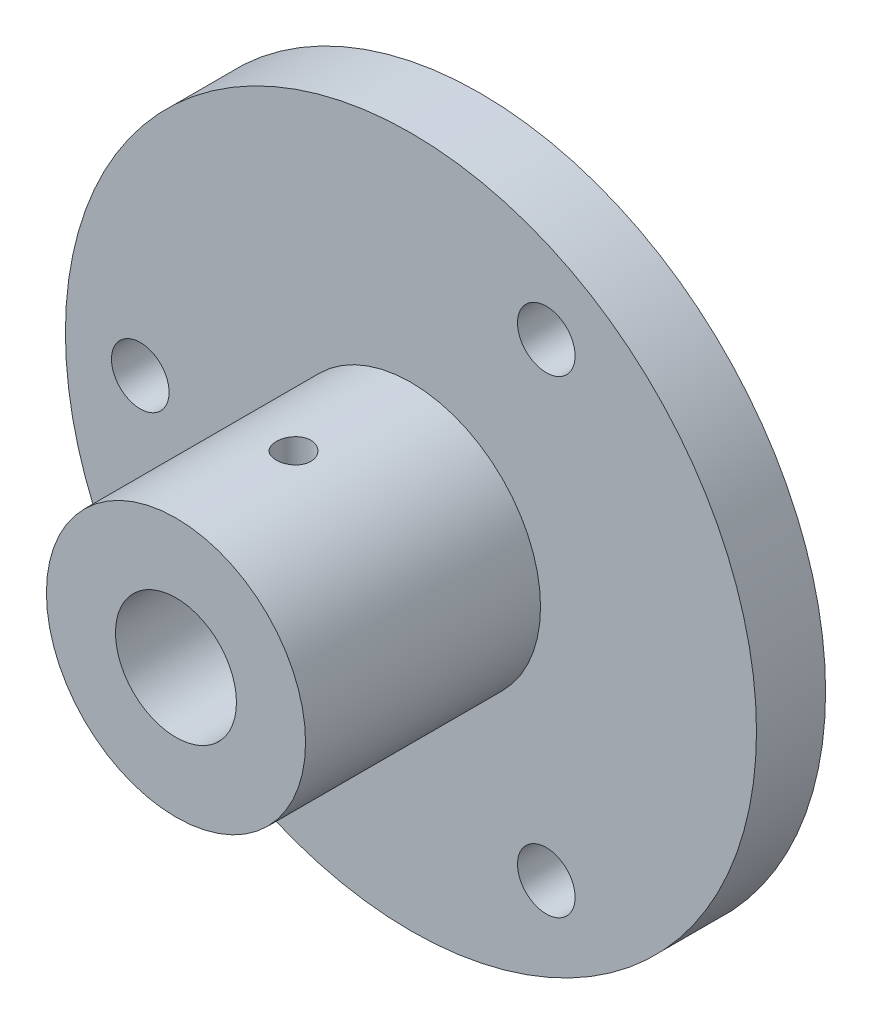
ISO-10303-21;
HEADER;
FILE_DESCRIPTION(('STEP AP214'),'2;1');
FILE_NAME('part.step','',(''),(''),'','','');
FILE_SCHEMA(('AUTOMOTIVE_DESIGN { 1 0 10303 214 1 1 1 1 }'));
ENDSEC;
DATA;
#1=APPLICATION_CONTEXT('core data for automotive mechanical design processes');
#2=APPLICATION_PROTOCOL_DEFINITION('international standard','automotive_design',2000,#1);
#3=PRODUCT_CONTEXT('',#1,'mechanical');
#4=PRODUCT('Part','Part','',(#3));
#5=PRODUCT_RELATED_PRODUCT_CATEGORY('part','',(#4));
#6=PRODUCT_DEFINITION_FORMATION('','',#4);
#7=PRODUCT_DEFINITION_CONTEXT('part definition',#1,'design');
#8=PRODUCT_DEFINITION('design','',#6,#7);
#9=PRODUCT_DEFINITION_SHAPE('','',#8);
#10=(LENGTH_UNIT() NAMED_UNIT(*) SI_UNIT(.MILLI.,.METRE.));
#11=(NAMED_UNIT(*) PLANE_ANGLE_UNIT() SI_UNIT($,.RADIAN.));
#12=(NAMED_UNIT(*) SI_UNIT($,.STERADIAN.) SOLID_ANGLE_UNIT());
#13=UNCERTAINTY_MEASURE_WITH_UNIT(LENGTH_MEASURE(1.E-05),#10,'distance_accuracy_value','');
#14=(GEOMETRIC_REPRESENTATION_CONTEXT(3) GLOBAL_UNCERTAINTY_ASSIGNED_CONTEXT((#13)) GLOBAL_UNIT_ASSIGNED_CONTEXT((#10,
#11,#12)) REPRESENTATION_CONTEXT('',''));
#15=CARTESIAN_POINT('',(0.,0.,0.));
#16=DIRECTION('',(0.,0.,1.));
#17=DIRECTION('',(1.,0.,0.));
#18=AXIS2_PLACEMENT_3D('',#15,#16,#17);
#19=CARTESIAN_POINT('',(0.,0.,6.));
#20=DIRECTION('',(0.,0.,-1.));
#21=DIRECTION('',(-1.,0.,0.));
#22=AXIS2_PLACEMENT_3D('',#19,#20,#21);
#23=CYLINDRICAL_SURFACE('',#22,5.25);
#24=CARTESIAN_POINT('',(0.,-5.25,14.7));
#25=CARTESIAN_POINT('',(0.0824661767829384,-5.24999901970756,14.7000014546715));
#26=CARTESIAN_POINT('',(0.164947310904436,-5.24803813051532,14.7068233417321));
#27=CARTESIAN_POINT('',(0.327518993397741,-5.24040679458827,14.7338732025767));
#28=CARTESIAN_POINT('',(0.407608625122212,-5.23473494407563,14.7541062495556));
#29=CARTESIAN_POINT('',(0.563028225553403,-5.22030518511805,14.8072560288124));
#30=CARTESIAN_POINT('',(0.638364660636168,-5.21155158079756,14.840155077114));
#31=CARTESIAN_POINT('',(0.782451570846953,-5.19187483737408,14.9176334936088));
#32=CARTESIAN_POINT('',(0.851201355883623,-5.18095147131017,14.9622140838678));
#33=CARTESIAN_POINT('',(0.981970835144209,-5.15778550969185,15.0630262580047));
#34=CARTESIAN_POINT('',(1.0437927917857,-5.14551781458893,15.1195085653915));
#35=CARTESIAN_POINT('',(1.15722851844326,-5.12120051186731,15.2419858073533));
#36=CARTESIAN_POINT('',(1.20884075780837,-5.10915093719508,15.3079821657242));
#37=CARTESIAN_POINT('',(1.30139842504823,-5.08637261156541,15.4492451870932));
#38=CARTESIAN_POINT('',(1.34210865827511,-5.07567526879513,15.5246714887986));
#39=CARTESIAN_POINT('',(1.41018877915485,-5.057185078805,15.6816540088131));
#40=CARTESIAN_POINT('',(1.43756153666789,-5.04939160683653,15.7632089040532));
#41=CARTESIAN_POINT('',(1.47748824760406,-5.03785206147012,15.9279260723742));
#42=CARTESIAN_POINT('',(1.49040414902137,-5.03400733927508,16.0109935220759));
#43=CARTESIAN_POINT('',(1.50218000841888,-5.03050656151496,16.1781983613346));
#44=CARTESIAN_POINT('',(1.50104302057216,-5.03084959580709,16.2623355144377));
#45=CARTESIAN_POINT('',(1.48503101072177,-5.03559775807451,16.4264014585921));
#46=CARTESIAN_POINT('',(1.47060244296293,-5.03987087023452,16.5063782633856));
#47=CARTESIAN_POINT('',(1.42913539564342,-5.05178511287108,16.6627254147207));
#48=CARTESIAN_POINT('',(1.40209577610937,-5.05942654782302,16.7390954345404));
#49=CARTESIAN_POINT('',(1.33583010853359,-5.0773264763706,16.8871846833239));
#50=CARTESIAN_POINT('',(1.29645413379661,-5.08761687304236,16.9588328043013));
#51=CARTESIAN_POINT('',(1.20673784375914,-5.10963912661544,17.0946574209101));
#52=CARTESIAN_POINT('',(1.15639508755009,-5.12137130416434,17.1588322483012));
#53=CARTESIAN_POINT('',(1.04392799754766,-5.14549687992267,17.2804292817048));
#54=CARTESIAN_POINT('',(0.981431156133996,-5.15789853429274,17.3375058569754));
#55=CARTESIAN_POINT('',(0.84759921178967,-5.18157185413758,17.4404445027302));
#56=CARTESIAN_POINT('',(0.77626365111142,-5.19284346103369,17.4863059920313));
#57=CARTESIAN_POINT('',(0.626192304818584,-5.21307396049126,17.5656965510805));
#58=CARTESIAN_POINT('',(0.547417363357503,-5.22201956622922,17.5991552151031));
#59=CARTESIAN_POINT('',(0.385044922475602,-5.23649438615689,17.6522504185626));
#60=CARTESIAN_POINT('',(0.30144864435761,-5.24202446142191,17.671890441934));
#61=CARTESIAN_POINT('',(0.134749791483263,-5.24891155886005,17.6962299642821));
#62=CARTESIAN_POINT('',(0.0517210101453815,-5.25039954637952,17.7013985215298));
#63=CARTESIAN_POINT('',(-0.114019895104186,-5.24941563530316,17.6979545502742));
#64=CARTESIAN_POINT('',(-0.196732055817828,-5.24694421185463,17.6893436753656));
#65=CARTESIAN_POINT('',(-0.357763975072738,-5.23840445013913,17.6589671667628));
#66=CARTESIAN_POINT('',(-0.436138658801141,-5.23240959763292,17.6374701140074));
#67=CARTESIAN_POINT('',(-0.588156514654222,-5.21750999056379,17.5822496235115));
#68=CARTESIAN_POINT('',(-0.661799138436506,-5.20860489949282,17.5485247718331));
#69=CARTESIAN_POINT('',(-0.804031263840056,-5.18857470876985,17.4689824975161));
#70=CARTESIAN_POINT('',(-0.87247686490519,-5.17740572384231,17.4229191008807));
#71=CARTESIAN_POINT('',(-1.00082889604448,-5.15413460323354,17.320310620537));
#72=CARTESIAN_POINT('',(-1.06073337813182,-5.14203225564551,17.2637631524528));
#73=CARTESIAN_POINT('',(-1.17232982125553,-5.11776464723921,17.1395929934616));
#74=CARTESIAN_POINT('',(-1.22368907055715,-5.10561027650693,17.0716685433257));
#75=CARTESIAN_POINT('',(-1.31429648704887,-5.08304171044126,16.9279030585365));
#76=CARTESIAN_POINT('',(-1.35354507560828,-5.0726274545694,16.8520622994402));
#77=CARTESIAN_POINT('',(-1.41853090589126,-5.05483988458072,16.6949315917562));
#78=CARTESIAN_POINT('',(-1.44433974931833,-5.04745050118527,16.6136731773205));
#79=CARTESIAN_POINT('',(-1.48184587553056,-5.03656842598251,16.4477175482592));
#80=CARTESIAN_POINT('',(-1.49354743426742,-5.0330745534607,16.3630213836735));
#81=CARTESIAN_POINT('',(-1.50223518184644,-5.03048777321363,16.1960279753088));
#82=CARTESIAN_POINT('',(-1.49976020733171,-5.03123370599554,16.1137608715856));
#83=CARTESIAN_POINT('',(-1.48143533218232,-5.03665947911099,15.9508689520007));
#84=CARTESIAN_POINT('',(-1.4655858778494,-5.04133918817575,15.8702440814302));
#85=CARTESIAN_POINT('',(-1.42129476612471,-5.05400232868674,15.7137162216244));
#86=CARTESIAN_POINT('',(-1.39298318839765,-5.06195157786269,15.6377734597418));
#87=CARTESIAN_POINT('',(-1.32467211976195,-5.08025477132046,15.4916559491306));
#88=CARTESIAN_POINT('',(-1.28467056032367,-5.0906091411192,15.421482224045));
#89=CARTESIAN_POINT('',(-1.19254909901119,-5.11298751712321,15.2863623586461));
#90=CARTESIAN_POINT('',(-1.14006920792048,-5.12505572384263,15.2216689564935));
#91=CARTESIAN_POINT('',(-1.02514488028452,-5.14927383819209,15.1018320781426));
#92=CARTESIAN_POINT('',(-0.962697938046421,-5.16142376562885,15.0466910106669));
#93=CARTESIAN_POINT('',(-0.827680740649044,-5.18480969679264,14.946122111755));
#94=CARTESIAN_POINT('',(-0.754891876769836,-5.19601425778057,14.9009797595478));
#95=CARTESIAN_POINT('',(-0.602437897234997,-5.21588546833481,14.8236406612335));
#96=CARTESIAN_POINT('',(-0.522776568086056,-5.22455350402716,14.7914368410502));
#97=CARTESIAN_POINT('',(-0.369687236501277,-5.2374550854398,14.7443643364534));
#98=CARTESIAN_POINT('',(-0.296822255718294,-5.24212263271557,14.7277698474866));
#99=CARTESIAN_POINT('',(-0.149308776589776,-5.24839532889111,14.7055877570684));
#100=CARTESIAN_POINT('',(-0.0746605182120689,-5.25000088750497,14.6999986830173));
#101=CARTESIAN_POINT('',(0.,-5.25,14.7));
#102=B_SPLINE_CURVE_WITH_KNOTS('',3,(#24,#25,#26,#27,#28,#29,#30,#31,#32,#33,#34,#35,#36,#37,
#38,#39,#40,#41,#42,#43,#44,#45,#46,#47,#48,#49,#50,#51,#52,#53,#54,#55,#56,#57,#58,#59,#60,#61,
#62,#63,#64,#65,#66,#67,#68,#69,#70,#71,#72,#73,#74,#75,#76,#77,#78,#79,#80,#81,#82,#83,#84,#85,
#86,#87,#88,#89,#90,#91,#92,#93,#94,#95,#96,#97,#98,#99,#100,#101),.UNSPECIFIED.,.T.,.F.,(4,2,2,
2,2,2,2,2,2,2,2,2,2,2,2,2,2,2,2,2,2,2,2,2,2,2,2,2,2,2,2,2,2,2,2,2,2,2,4),(0.,0.247124484406758,
0.494342504846385,0.741216609671507,0.988116551576369,1.24085858648086,1.49363848405285,
1.75149806475043,2.00930213658607,2.26049632397063,2.51163591923425,2.75463589372,
2.99765783839594,3.24375602468408,3.48990904183007,3.74533875451876,4.00078170116587,
4.25765325828336,4.51446003010959,4.7628409327365,5.01119203075986,5.2545385535964,
5.49791322431647,5.74655644008339,5.99525627390841,6.25209078663251,6.50891636223973,
6.76435930022607,7.01972479336604,7.26545011208158,7.51116723135287,7.75437822214251,
7.99763227493985,8.24900742663575,8.50044587327156,8.75833484223425,9.01608261921368,
9.23984601024261,9.46357945816591),.UNSPECIFIED.);
#103=CARTESIAN_POINT('',(0.,-5.25,14.7));
#104=VERTEX_POINT('',#103);
#105=EDGE_CURVE('E82',#104,#104,#102,.T.);
#106=ORIENTED_EDGE('',*,*,#105,.T.);
#107=EDGE_LOOP('',(#106));
#108=FACE_BOUND('',#107,.T.);
#109=CARTESIAN_POINT('',(0.,0.,0.));
#110=DIRECTION('',(0.,0.,1.));
#111=DIRECTION('',(1.,0.,0.));
#112=AXIS2_PLACEMENT_3D('',#109,#110,#111);
#113=CIRCLE('',#112,5.25);
#114=CARTESIAN_POINT('',(5.25,0.,0.));
#115=VERTEX_POINT('',#114);
#116=EDGE_CURVE('E134',#115,#115,#113,.T.);
#117=ORIENTED_EDGE('',*,*,#116,.F.);
#118=EDGE_LOOP('',(#117));
#119=FACE_BOUND('',#118,.T.);
#120=CARTESIAN_POINT('',(0.,0.,26.4));
#121=DIRECTION('',(0.,0.,1.));
#122=DIRECTION('',(1.,0.,0.));
#123=AXIS2_PLACEMENT_3D('',#120,#121,#122);
#124=CIRCLE('',#123,5.25);
#125=CARTESIAN_POINT('',(5.25,0.,26.4));
#126=VERTEX_POINT('',#125);
#127=EDGE_CURVE('E160',#126,#126,#124,.T.);
#128=ORIENTED_EDGE('',*,*,#127,.T.);
#129=EDGE_LOOP('',(#128));
#130=FACE_BOUND('',#129,.T.);
#131=CARTESIAN_POINT('',(0.,5.25,14.7));
#132=CARTESIAN_POINT('',(-0.0824661767829384,5.24999901970756,14.7000014546715));
#133=CARTESIAN_POINT('',(-0.164947310904436,5.24803813051532,14.7068233417321));
#134=CARTESIAN_POINT('',(-0.327518993397741,5.24040679458827,14.7338732025767));
#135=CARTESIAN_POINT('',(-0.407608625122212,5.23473494407563,14.7541062495556));
#136=CARTESIAN_POINT('',(-0.563028225553403,5.22030518511805,14.8072560288124));
#137=CARTESIAN_POINT('',(-0.638364660636168,5.21155158079756,14.840155077114));
#138=CARTESIAN_POINT('',(-0.782451570846953,5.19187483737408,14.9176334936088));
#139=CARTESIAN_POINT('',(-0.851201355883623,5.18095147131017,14.9622140838678));
#140=CARTESIAN_POINT('',(-0.981970835144209,5.15778550969185,15.0630262580047));
#141=CARTESIAN_POINT('',(-1.0437927917857,5.14551781458893,15.1195085653915));
#142=CARTESIAN_POINT('',(-1.15722851844326,5.12120051186731,15.2419858073533));
#143=CARTESIAN_POINT('',(-1.20884075780837,5.10915093719508,15.3079821657242));
#144=CARTESIAN_POINT('',(-1.30139842504823,5.08637261156541,15.4492451870932));
#145=CARTESIAN_POINT('',(-1.34210865827511,5.07567526879513,15.5246714887986));
#146=CARTESIAN_POINT('',(-1.41018877915485,5.057185078805,15.6816540088131));
#147=CARTESIAN_POINT('',(-1.43756153666789,5.04939160683653,15.7632089040532));
#148=CARTESIAN_POINT('',(-1.47748824760406,5.03785206147012,15.9279260723742));
#149=CARTESIAN_POINT('',(-1.49040414902137,5.03400733927508,16.0109935220759));
#150=CARTESIAN_POINT('',(-1.50218000841888,5.03050656151496,16.1781983613346));
#151=CARTESIAN_POINT('',(-1.50104302057216,5.03084959580709,16.2623355144377));
#152=CARTESIAN_POINT('',(-1.48503101072177,5.03559775807451,16.4264014585921));
#153=CARTESIAN_POINT('',(-1.47060244296293,5.03987087023452,16.5063782633856));
#154=CARTESIAN_POINT('',(-1.42913539564342,5.05178511287108,16.6627254147207));
#155=CARTESIAN_POINT('',(-1.40209577610937,5.05942654782302,16.7390954345404));
#156=CARTESIAN_POINT('',(-1.33583010853359,5.0773264763706,16.8871846833239));
#157=CARTESIAN_POINT('',(-1.29645413379661,5.08761687304236,16.9588328043013));
#158=CARTESIAN_POINT('',(-1.20673784375914,5.10963912661544,17.0946574209101));
#159=CARTESIAN_POINT('',(-1.15639508755009,5.12137130416434,17.1588322483012));
#160=CARTESIAN_POINT('',(-1.04392799754766,5.14549687992267,17.2804292817048));
#161=CARTESIAN_POINT('',(-0.981431156133996,5.15789853429274,17.3375058569754));
#162=CARTESIAN_POINT('',(-0.84759921178967,5.18157185413758,17.4404445027302));
#163=CARTESIAN_POINT('',(-0.77626365111142,5.19284346103369,17.4863059920313));
#164=CARTESIAN_POINT('',(-0.626192304818584,5.21307396049126,17.5656965510805));
#165=CARTESIAN_POINT('',(-0.547417363357503,5.22201956622922,17.5991552151031));
#166=CARTESIAN_POINT('',(-0.385044922475602,5.23649438615689,17.6522504185626));
#167=CARTESIAN_POINT('',(-0.30144864435761,5.24202446142191,17.671890441934));
#168=CARTESIAN_POINT('',(-0.134749791483263,5.24891155886005,17.6962299642821));
#169=CARTESIAN_POINT('',(-0.0517210101453815,5.25039954637952,17.7013985215298));
#170=CARTESIAN_POINT('',(0.114019895104186,5.24941563530316,17.6979545502742));
#171=CARTESIAN_POINT('',(0.196732055817828,5.24694421185463,17.6893436753656));
#172=CARTESIAN_POINT('',(0.357763975072738,5.23840445013913,17.6589671667628));
#173=CARTESIAN_POINT('',(0.436138658801141,5.23240959763292,17.6374701140074));
#174=CARTESIAN_POINT('',(0.588156514654222,5.21750999056379,17.5822496235115));
#175=CARTESIAN_POINT('',(0.661799138436506,5.20860489949282,17.5485247718331));
#176=CARTESIAN_POINT('',(0.804031263840056,5.18857470876985,17.4689824975161));
#177=CARTESIAN_POINT('',(0.87247686490519,5.17740572384231,17.4229191008807));
#178=CARTESIAN_POINT('',(1.00082889604448,5.15413460323354,17.320310620537));
#179=CARTESIAN_POINT('',(1.06073337813182,5.14203225564551,17.2637631524528));
#180=CARTESIAN_POINT('',(1.17232982125553,5.11776464723921,17.1395929934616));
#181=CARTESIAN_POINT('',(1.22368907055715,5.10561027650693,17.0716685433257));
#182=CARTESIAN_POINT('',(1.31429648704887,5.08304171044126,16.9279030585365));
#183=CARTESIAN_POINT('',(1.35354507560828,5.0726274545694,16.8520622994402));
#184=CARTESIAN_POINT('',(1.41853090589126,5.05483988458072,16.6949315917562));
#185=CARTESIAN_POINT('',(1.44433974931833,5.04745050118527,16.6136731773205));
#186=CARTESIAN_POINT('',(1.48184587553056,5.03656842598251,16.4477175482592));
#187=CARTESIAN_POINT('',(1.49354743426742,5.0330745534607,16.3630213836735));
#188=CARTESIAN_POINT('',(1.50223518184644,5.03048777321363,16.1960279753088));
#189=CARTESIAN_POINT('',(1.49976020733171,5.03123370599554,16.1137608715856));
#190=CARTESIAN_POINT('',(1.48143533218232,5.03665947911099,15.9508689520007));
#191=CARTESIAN_POINT('',(1.4655858778494,5.04133918817575,15.8702440814302));
#192=CARTESIAN_POINT('',(1.42129476612471,5.05400232868674,15.7137162216244));
#193=CARTESIAN_POINT('',(1.39298318839765,5.06195157786269,15.6377734597418));
#194=CARTESIAN_POINT('',(1.32467211976195,5.08025477132046,15.4916559491306));
#195=CARTESIAN_POINT('',(1.28467056032367,5.0906091411192,15.421482224045));
#196=CARTESIAN_POINT('',(1.19254909901119,5.11298751712321,15.2863623586461));
#197=CARTESIAN_POINT('',(1.14006920792048,5.12505572384263,15.2216689564935));
#198=CARTESIAN_POINT('',(1.02514488028452,5.14927383819209,15.1018320781426));
#199=CARTESIAN_POINT('',(0.962697938046421,5.16142376562885,15.0466910106669));
#200=CARTESIAN_POINT('',(0.827680740649044,5.18480969679264,14.946122111755));
#201=CARTESIAN_POINT('',(0.754891876769836,5.19601425778057,14.9009797595478));
#202=CARTESIAN_POINT('',(0.602437897234997,5.21588546833481,14.8236406612335));
#203=CARTESIAN_POINT('',(0.522776568086056,5.22455350402716,14.7914368410502));
#204=CARTESIAN_POINT('',(0.369687236501277,5.2374550854398,14.7443643364534));
#205=CARTESIAN_POINT('',(0.296822255718294,5.24212263271557,14.7277698474866));
#206=CARTESIAN_POINT('',(0.149308776589776,5.24839532889111,14.7055877570684));
#207=CARTESIAN_POINT('',(0.0746605182120689,5.25000088750497,14.6999986830173));
#208=CARTESIAN_POINT('',(0.,5.25,14.7));
#209=B_SPLINE_CURVE_WITH_KNOTS('',3,(#131,#132,#133,#134,#135,#136,#137,#138,#139,#140,#141,
#142,#143,#144,#145,#146,#147,#148,#149,#150,#151,#152,#153,#154,#155,#156,#157,#158,#159,#160,
#161,#162,#163,#164,#165,#166,#167,#168,#169,#170,#171,#172,#173,#174,#175,#176,#177,#178,#179,
#180,#181,#182,#183,#184,#185,#186,#187,#188,#189,#190,#191,#192,#193,#194,#195,#196,#197,#198,
#199,#200,#201,#202,#203,#204,#205,#206,#207,#208),.UNSPECIFIED.,.T.,.F.,(4,2,2,2,2,2,2,2,2,2,2,
2,2,2,2,2,2,2,2,2,2,2,2,2,2,2,2,2,2,2,2,2,2,2,2,2,2,2,4),(0.,0.247124484406758,
0.494342504846385,0.741216609671507,0.988116551576369,1.24085858648086,1.49363848405285,
1.75149806475043,2.00930213658607,2.26049632397063,2.51163591923425,2.75463589372,
2.99765783839594,3.24375602468408,3.48990904183007,3.74533875451876,4.00078170116587,
4.25765325828336,4.51446003010959,4.7628409327365,5.01119203075986,5.2545385535964,
5.49791322431647,5.74655644008339,5.99525627390841,6.25209078663251,6.50891636223973,
6.76435930022607,7.01972479336604,7.26545011208158,7.51116723135287,7.75437822214251,
7.99763227493985,8.24900742663575,8.50044587327156,8.75833484223425,9.01608261921368,
9.23984601024261,9.46357945816591),.UNSPECIFIED.);
#210=CARTESIAN_POINT('',(0.,5.25,14.7));
#211=VERTEX_POINT('',#210);
#212=EDGE_CURVE('E87',#211,#211,#209,.T.);
#213=ORIENTED_EDGE('',*,*,#212,.T.);
#214=EDGE_LOOP('',(#213));
#215=FACE_BOUND('',#214,.T.);
#216=ADVANCED_FACE('F39',(#108,#119,#130,#215),#23,.F.);
#217=CARTESIAN_POINT('',(0.,0.,26.4));
#218=DIRECTION('',(0.,0.,-1.));
#219=DIRECTION('',(-1.,0.,0.));
#220=AXIS2_PLACEMENT_3D('',#217,#218,#219);
#221=CYLINDRICAL_SURFACE('',#220,11.25);
#222=CARTESIAN_POINT('',(0.,0.,26.4));
#223=DIRECTION('',(0.,0.,1.));
#224=DIRECTION('',(1.,0.,0.));
#225=AXIS2_PLACEMENT_3D('',#222,#223,#224);
#226=CIRCLE('',#225,11.25);
#227=CARTESIAN_POINT('',(11.25,0.,26.4));
#228=VERTEX_POINT('',#227);
#229=EDGE_CURVE('E136',#228,#228,#226,.T.);
#230=ORIENTED_EDGE('',*,*,#229,.F.);
#231=EDGE_LOOP('',(#230));
#232=FACE_BOUND('',#231,.T.);
#233=CARTESIAN_POINT('',(0.,0.,6.));
#234=DIRECTION('',(0.,0.,1.));
#235=DIRECTION('',(1.,0.,0.));
#236=AXIS2_PLACEMENT_3D('',#233,#234,#235);
#237=CIRCLE('',#236,11.25);
#238=CARTESIAN_POINT('',(11.25,0.,6.));
#239=VERTEX_POINT('',#238);
#240=EDGE_CURVE('E141',#239,#239,#237,.T.);
#241=ORIENTED_EDGE('',*,*,#240,.T.);
#242=EDGE_LOOP('',(#241));
#243=FACE_BOUND('',#242,.T.);
#244=CARTESIAN_POINT('',(0.,-11.25,14.7));
#245=CARTESIAN_POINT('',(0.0838566267519633,-11.2499987680691,14.7000035322802));
#246=CARTESIAN_POINT('',(0.16776448445721,-11.249052530454,14.7070556534719));
#247=CARTESIAN_POINT('',(0.333242043853559,-11.2453688334518,14.7350747617872));
#248=CARTESIAN_POINT('',(0.414809266749778,-11.2426295433129,14.7560559711729));
#249=CARTESIAN_POINT('',(0.573186234470238,-11.235668098868,14.8113012881561));
#250=CARTESIAN_POINT('',(0.649999262293871,-11.2314469815823,14.8455561082788));
#251=CARTESIAN_POINT('',(0.796772921272724,-11.2219903999529,14.9263551853547));
#252=CARTESIAN_POINT('',(0.866734654752769,-11.2167550991892,14.9728974608748));
#253=CARTESIAN_POINT('',(0.998269366878509,-11.2058174609247,15.0772599462031));
#254=CARTESIAN_POINT('',(1.0597934891219,-11.2001126862158,15.1351414837564));
#255=CARTESIAN_POINT('',(1.17228551754826,-11.1888985316846,15.2604076418075));
#256=CARTESIAN_POINT('',(1.22325286497916,-11.1833891622176,15.3277927649969));
#257=CARTESIAN_POINT('',(1.31336926701681,-11.1731657658014,15.4704743422088));
#258=CARTESIAN_POINT('',(1.35247205611933,-11.1684548832432,15.545800261859));
#259=CARTESIAN_POINT('',(1.41745383755468,-11.1603944053442,15.7020233004276));
#260=CARTESIAN_POINT('',(1.44333339933958,-11.1570447513841,15.782920179265));
#261=CARTESIAN_POINT('',(1.4809845507913,-11.152109524265,15.9474793578762));
#262=CARTESIAN_POINT('',(1.4928390317138,-11.150513590276,16.0311223758997));
#263=CARTESIAN_POINT('',(1.50236010411088,-11.1492348870699,16.1992246347045));
#264=CARTESIAN_POINT('',(1.50002734225201,-11.149552030653,16.2836838381082));
#265=CARTESIAN_POINT('',(1.48130809454426,-11.1520541682974,16.4504408475209));
#266=CARTESIAN_POINT('',(1.46501323148821,-11.1542269846676,16.5327491474143));
#267=CARTESIAN_POINT('',(1.41897543475779,-11.1601766458106,16.6934526275701));
#268=CARTESIAN_POINT('',(1.38923219446093,-11.163953527156,16.7718477185663));
#269=CARTESIAN_POINT('',(1.31704446857393,-11.1726994583327,16.9227822260304));
#270=CARTESIAN_POINT('',(1.27456048435312,-11.1776722059292,16.9953025283957));
#271=CARTESIAN_POINT('',(1.17812545008217,-11.1882467716495,17.1322193114382));
#272=CARTESIAN_POINT('',(1.12417380376789,-11.1938486224765,17.1966153694156));
#273=CARTESIAN_POINT('',(1.00582867519772,-11.2051042442519,17.3159872594364));
#274=CARTESIAN_POINT('',(0.941356280269833,-11.210758076559,17.3708848820267));
#275=CARTESIAN_POINT('',(0.804070627600053,-11.221439428637,17.4690915336963));
#276=CARTESIAN_POINT('',(0.731257345831775,-11.2264669466037,17.5124005293926));
#277=CARTESIAN_POINT('',(0.57929416479785,-11.2353329530768,17.5862018382711));
#278=CARTESIAN_POINT('',(0.50014168413092,-11.2391709540672,17.6166888982847));
#279=CARTESIAN_POINT('',(0.337778193252185,-11.2452211942805,17.6639169892293));
#280=CARTESIAN_POINT('',(0.254567399656691,-11.2474335201745,17.6806587529795));
#281=CARTESIAN_POINT('',(0.0871251774942311,-11.2499718103264,17.6998188245783));
#282=CARTESIAN_POINT('',(0.00290627591028013,-11.2503119538678,17.7023448013376));
#283=CARTESIAN_POINT('',(-0.16475371291404,-11.2491059365389,17.6932862519046));
#284=CARTESIAN_POINT('',(-0.24819481900925,-11.2475598215145,17.6817020686632));
#285=CARTESIAN_POINT('',(-0.411610286679705,-11.2427638151858,17.644841509962));
#286=CARTESIAN_POINT('',(-0.491596512384035,-11.2395203572719,17.6196168237584));
#287=CARTESIAN_POINT('',(-0.646203824095171,-11.2316925694072,17.5562452755472));
#288=CARTESIAN_POINT('',(-0.720824705261729,-11.2271081882958,17.5180979204901));
#289=CARTESIAN_POINT('',(-0.863061658962059,-11.2170737802756,17.4297058833125));
#290=CARTESIAN_POINT('',(-0.930634360797453,-11.2116188628429,17.379391975715));
#291=CARTESIAN_POINT('',(-1.05641471024392,-11.2004679653249,17.2681925030818));
#292=CARTESIAN_POINT('',(-1.11462193246784,-11.1947719743047,17.2073064581127));
#293=CARTESIAN_POINT('',(-1.22040412067324,-11.1837367685513,17.0762151430203));
#294=CARTESIAN_POINT('',(-1.26790745706704,-11.1784001158147,17.0059518249464));
#295=CARTESIAN_POINT('',(-1.35043763309111,-11.1687309975136,16.8583804422893));
#296=CARTESIAN_POINT('',(-1.3854647513276,-11.1643985095259,16.7810725350672));
#297=CARTESIAN_POINT('',(-1.4419337737556,-11.1572460883506,16.6218320684792));
#298=CARTESIAN_POINT('',(-1.46341521635097,-11.1544217567445,16.5399137360919));
#299=CARTESIAN_POINT('',(-1.49231000357969,-11.1505931152372,16.3735922759034));
#300=CARTESIAN_POINT('',(-1.49972410070086,-11.1495887079851,16.2891892812567));
#301=CARTESIAN_POINT('',(-1.50025864354642,-11.1495167347159,16.1210073818599));
#302=CARTESIAN_POINT('',(-1.49349164395869,-11.1504339171189,16.0372288192768));
#303=CARTESIAN_POINT('',(-1.46609532515017,-11.1540688790565,15.8720115936721));
#304=CARTESIAN_POINT('',(-1.44546601112451,-11.1567866579162,15.7905729297735));
#305=CARTESIAN_POINT('',(-1.39096732749155,-11.1637116770457,15.6323672375613));
#306=CARTESIAN_POINT('',(-1.35710415614281,-11.1679182199455,15.5555980416624));
#307=CARTESIAN_POINT('',(-1.27711007069803,-11.1773478428462,15.4088130871305));
#308=CARTESIAN_POINT('',(-1.23097891972821,-11.1825709424745,15.338797458933));
#309=CARTESIAN_POINT('',(-1.12734336382131,-11.193494753873,15.2069327625537));
#310=CARTESIAN_POINT('',(-1.06975520420176,-11.1991987931556,15.1451497891836));
#311=CARTESIAN_POINT('',(-0.945016270123677,-11.2104128925125,15.0320825877288));
#312=CARTESIAN_POINT('',(-0.877863255547331,-11.2159229067673,14.9808008259373));
#313=CARTESIAN_POINT('',(-0.735564740889616,-11.2261547635315,14.8899996461501));
#314=CARTESIAN_POINT('',(-0.660385965557974,-11.2308730982017,14.8505320000836));
#315=CARTESIAN_POINT('',(-0.504444307190497,-11.2389549049423,14.7848395510912));
#316=CARTESIAN_POINT('',(-0.423687509227417,-11.2423198269323,14.7586005685314));
#317=CARTESIAN_POINT('',(-0.285441306073813,-11.2465179130745,14.7262889952111));
#318=CARTESIAN_POINT('',(-0.228818311466833,-11.2478172272631,14.7164450673573));
#319=CARTESIAN_POINT('',(-0.114804878712083,-11.2495586886808,14.7032993893759));
#320=CARTESIAN_POINT('',(-0.05741444733843,-11.250000843471,14.6999975815398));
#321=CARTESIAN_POINT('',(0.,-11.25,14.7));
#322=B_SPLINE_CURVE_WITH_KNOTS('',3,(#244,#245,#246,#247,#248,#249,#250,#251,#252,#253,#254,
#255,#256,#257,#258,#259,#260,#261,#262,#263,#264,#265,#266,#267,#268,#269,#270,#271,#272,#273,
#274,#275,#276,#277,#278,#279,#280,#281,#282,#283,#284,#285,#286,#287,#288,#289,#290,#291,#292,
#293,#294,#295,#296,#297,#298,#299,#300,#301,#302,#303,#304,#305,#306,#307,#308,#309,#310,#311,
#312,#313,#314,#315,#316,#317,#318,#319,#320,#321),.UNSPECIFIED.,.T.,.F.,(4,2,2,2,2,2,2,2,2,2,2,
2,2,2,2,2,2,2,2,2,2,2,2,2,2,2,2,2,2,2,2,2,2,2,2,2,2,2,4),(0.,0.251360138479308,
0.502977323163784,0.754418769620554,1.00581969423026,1.25861983832669,1.51143335928627,
1.76522041133736,2.01899653324653,2.27126516935769,2.5235223069369,2.77413663823533,
3.02475668381888,3.27616187353424,3.52758013832848,3.78097908363637,4.03437875889222,
4.28788215151904,4.54137202793807,4.79293938744046,5.04450063265859,5.29511522547348,
5.5457393812766,5.79782456077413,6.04992118694071,6.30365778401588,6.55738871454786,
6.81037556051591,7.06334887337726,7.31432195622469,7.56529494501559,7.81615052776966,
8.06701095446927,8.3197775087633,8.57260335938371,8.82652145005887,9.08016678744314,
9.25226804285482,9.42436778014079),.UNSPECIFIED.);
#323=CARTESIAN_POINT('',(0.,-11.25,14.7));
#324=VERTEX_POINT('',#323);
#325=EDGE_CURVE('E62',#324,#324,#322,.T.);
#326=ORIENTED_EDGE('',*,*,#325,.F.);
#327=EDGE_LOOP('',(#326));
#328=FACE_BOUND('',#327,.T.);
#329=CARTESIAN_POINT('',(0.,11.25,14.7));
#330=CARTESIAN_POINT('',(-0.0838566267519633,11.2499987680691,14.7000035322802));
#331=CARTESIAN_POINT('',(-0.16776448445721,11.249052530454,14.7070556534719));
#332=CARTESIAN_POINT('',(-0.333242043853559,11.2453688334518,14.7350747617872));
#333=CARTESIAN_POINT('',(-0.414809266749778,11.2426295433129,14.7560559711729));
#334=CARTESIAN_POINT('',(-0.573186234470238,11.235668098868,14.8113012881561));
#335=CARTESIAN_POINT('',(-0.649999262293871,11.2314469815823,14.8455561082788));
#336=CARTESIAN_POINT('',(-0.796772921272724,11.2219903999529,14.9263551853547));
#337=CARTESIAN_POINT('',(-0.866734654752769,11.2167550991892,14.9728974608748));
#338=CARTESIAN_POINT('',(-0.998269366878509,11.2058174609247,15.0772599462031));
#339=CARTESIAN_POINT('',(-1.0597934891219,11.2001126862158,15.1351414837564));
#340=CARTESIAN_POINT('',(-1.17228551754826,11.1888985316846,15.2604076418075));
#341=CARTESIAN_POINT('',(-1.22325286497916,11.1833891622176,15.3277927649969));
#342=CARTESIAN_POINT('',(-1.31336926701681,11.1731657658014,15.4704743422088));
#343=CARTESIAN_POINT('',(-1.35247205611933,11.1684548832432,15.545800261859));
#344=CARTESIAN_POINT('',(-1.41745383755468,11.1603944053442,15.7020233004276));
#345=CARTESIAN_POINT('',(-1.44333339933958,11.1570447513841,15.782920179265));
#346=CARTESIAN_POINT('',(-1.4809845507913,11.152109524265,15.9474793578762));
#347=CARTESIAN_POINT('',(-1.4928390317138,11.150513590276,16.0311223758997));
#348=CARTESIAN_POINT('',(-1.50236010411088,11.1492348870699,16.1992246347045));
#349=CARTESIAN_POINT('',(-1.50002734225201,11.149552030653,16.2836838381082));
#350=CARTESIAN_POINT('',(-1.48130809454426,11.1520541682974,16.4504408475209));
#351=CARTESIAN_POINT('',(-1.46501323148821,11.1542269846676,16.5327491474143));
#352=CARTESIAN_POINT('',(-1.41897543475779,11.1601766458106,16.6934526275701));
#353=CARTESIAN_POINT('',(-1.38923219446093,11.163953527156,16.7718477185663));
#354=CARTESIAN_POINT('',(-1.31704446857393,11.1726994583327,16.9227822260304));
#355=CARTESIAN_POINT('',(-1.27456048435312,11.1776722059292,16.9953025283957));
#356=CARTESIAN_POINT('',(-1.17812545008217,11.1882467716495,17.1322193114382));
#357=CARTESIAN_POINT('',(-1.12417380376789,11.1938486224765,17.1966153694156));
#358=CARTESIAN_POINT('',(-1.00582867519772,11.2051042442519,17.3159872594364));
#359=CARTESIAN_POINT('',(-0.941356280269833,11.210758076559,17.3708848820267));
#360=CARTESIAN_POINT('',(-0.804070627600053,11.221439428637,17.4690915336963));
#361=CARTESIAN_POINT('',(-0.731257345831775,11.2264669466037,17.5124005293926));
#362=CARTESIAN_POINT('',(-0.57929416479785,11.2353329530768,17.5862018382711));
#363=CARTESIAN_POINT('',(-0.50014168413092,11.2391709540672,17.6166888982847));
#364=CARTESIAN_POINT('',(-0.337778193252185,11.2452211942805,17.6639169892293));
#365=CARTESIAN_POINT('',(-0.254567399656691,11.2474335201745,17.6806587529795));
#366=CARTESIAN_POINT('',(-0.0871251774942311,11.2499718103264,17.6998188245783));
#367=CARTESIAN_POINT('',(-0.00290627591028013,11.2503119538678,17.7023448013376));
#368=CARTESIAN_POINT('',(0.16475371291404,11.2491059365389,17.6932862519046));
#369=CARTESIAN_POINT('',(0.24819481900925,11.2475598215145,17.6817020686632));
#370=CARTESIAN_POINT('',(0.411610286679705,11.2427638151858,17.644841509962));
#371=CARTESIAN_POINT('',(0.491596512384035,11.2395203572719,17.6196168237584));
#372=CARTESIAN_POINT('',(0.646203824095171,11.2316925694072,17.5562452755472));
#373=CARTESIAN_POINT('',(0.720824705261729,11.2271081882958,17.5180979204901));
#374=CARTESIAN_POINT('',(0.863061658962059,11.2170737802756,17.4297058833125));
#375=CARTESIAN_POINT('',(0.930634360797453,11.2116188628429,17.379391975715));
#376=CARTESIAN_POINT('',(1.05641471024392,11.2004679653249,17.2681925030818));
#377=CARTESIAN_POINT('',(1.11462193246784,11.1947719743047,17.2073064581127));
#378=CARTESIAN_POINT('',(1.22040412067324,11.1837367685513,17.0762151430203));
#379=CARTESIAN_POINT('',(1.26790745706704,11.1784001158147,17.0059518249464));
#380=CARTESIAN_POINT('',(1.35043763309111,11.1687309975136,16.8583804422893));
#381=CARTESIAN_POINT('',(1.3854647513276,11.1643985095259,16.7810725350672));
#382=CARTESIAN_POINT('',(1.4419337737556,11.1572460883506,16.6218320684792));
#383=CARTESIAN_POINT('',(1.46341521635097,11.1544217567445,16.5399137360919));
#384=CARTESIAN_POINT('',(1.49231000357969,11.1505931152372,16.3735922759034));
#385=CARTESIAN_POINT('',(1.49972410070086,11.1495887079851,16.2891892812567));
#386=CARTESIAN_POINT('',(1.50025864354642,11.1495167347159,16.1210073818599));
#387=CARTESIAN_POINT('',(1.49349164395869,11.1504339171189,16.0372288192768));
#388=CARTESIAN_POINT('',(1.46609532515017,11.1540688790565,15.8720115936721));
#389=CARTESIAN_POINT('',(1.44546601112451,11.1567866579162,15.7905729297735));
#390=CARTESIAN_POINT('',(1.39096732749155,11.1637116770457,15.6323672375613));
#391=CARTESIAN_POINT('',(1.35710415614281,11.1679182199455,15.5555980416624));
#392=CARTESIAN_POINT('',(1.27711007069803,11.1773478428462,15.4088130871305));
#393=CARTESIAN_POINT('',(1.23097891972821,11.1825709424745,15.338797458933));
#394=CARTESIAN_POINT('',(1.12734336382131,11.193494753873,15.2069327625537));
#395=CARTESIAN_POINT('',(1.06975520420176,11.1991987931556,15.1451497891836));
#396=CARTESIAN_POINT('',(0.945016270123677,11.2104128925125,15.0320825877288));
#397=CARTESIAN_POINT('',(0.877863255547331,11.2159229067673,14.9808008259373));
#398=CARTESIAN_POINT('',(0.735564740889616,11.2261547635315,14.8899996461501));
#399=CARTESIAN_POINT('',(0.660385965557974,11.2308730982017,14.8505320000836));
#400=CARTESIAN_POINT('',(0.504444307190497,11.2389549049423,14.7848395510912));
#401=CARTESIAN_POINT('',(0.423687509227417,11.2423198269323,14.7586005685314));
#402=CARTESIAN_POINT('',(0.285441306073813,11.2465179130745,14.7262889952111));
#403=CARTESIAN_POINT('',(0.228818311466833,11.2478172272631,14.7164450673573));
#404=CARTESIAN_POINT('',(0.114804878712083,11.2495586886808,14.7032993893759));
#405=CARTESIAN_POINT('',(0.05741444733843,11.250000843471,14.6999975815398));
#406=CARTESIAN_POINT('',(0.,11.25,14.7));
#407=B_SPLINE_CURVE_WITH_KNOTS('',3,(#329,#330,#331,#332,#333,#334,#335,#336,#337,#338,#339,
#340,#341,#342,#343,#344,#345,#346,#347,#348,#349,#350,#351,#352,#353,#354,#355,#356,#357,#358,
#359,#360,#361,#362,#363,#364,#365,#366,#367,#368,#369,#370,#371,#372,#373,#374,#375,#376,#377,
#378,#379,#380,#381,#382,#383,#384,#385,#386,#387,#388,#389,#390,#391,#392,#393,#394,#395,#396,
#397,#398,#399,#400,#401,#402,#403,#404,#405,#406),.UNSPECIFIED.,.T.,.F.,(4,2,2,2,2,2,2,2,2,2,2,
2,2,2,2,2,2,2,2,2,2,2,2,2,2,2,2,2,2,2,2,2,2,2,2,2,2,2,4),(0.,0.251360138479308,
0.502977323163784,0.754418769620554,1.00581969423026,1.25861983832669,1.51143335928627,
1.76522041133736,2.01899653324653,2.27126516935769,2.5235223069369,2.77413663823533,
3.02475668381888,3.27616187353424,3.52758013832848,3.78097908363637,4.03437875889222,
4.28788215151904,4.54137202793807,4.79293938744046,5.04450063265859,5.29511522547348,
5.5457393812766,5.79782456077413,6.04992118694071,6.30365778401588,6.55738871454786,
6.81037556051591,7.06334887337726,7.31432195622469,7.56529494501559,7.81615052776966,
8.06701095446927,8.3197775087633,8.57260335938371,8.82652145005887,9.08016678744314,
9.25226804285482,9.42436778014079),.UNSPECIFIED.);
#408=CARTESIAN_POINT('',(0.,11.25,14.7));
#409=VERTEX_POINT('',#408);
#410=EDGE_CURVE('E43',#409,#409,#407,.T.);
#411=ORIENTED_EDGE('',*,*,#410,.F.);
#412=EDGE_LOOP('',(#411));
#413=FACE_BOUND('',#412,.T.);
#414=ADVANCED_FACE('F67',(#232,#243,#328,#413),#221,.T.);
#415=CARTESIAN_POINT('',(0.,0.,6.));
#416=DIRECTION('',(0.,0.,1.));
#417=DIRECTION('',(1.,0.,0.));
#418=AXIS2_PLACEMENT_3D('',#415,#416,#417);
#419=PLANE('',#418);
#420=CARTESIAN_POINT('',(11.75,-20.3515969889343,6.));
#421=DIRECTION('',(0.,0.,1.));
#422=DIRECTION('',(1.,0.,0.));
#423=AXIS2_PLACEMENT_3D('',#420,#421,#422);
#424=CIRCLE('',#423,2.5);
#425=CARTESIAN_POINT('',(14.25,-20.3515969889343,6.));
#426=VERTEX_POINT('',#425);
#427=EDGE_CURVE('E147',#426,#426,#424,.T.);
#428=ORIENTED_EDGE('',*,*,#427,.F.);
#429=EDGE_LOOP('',(#428));
#430=FACE_BOUND('',#429,.T.);
#431=CARTESIAN_POINT('',(0.,0.,6.));
#432=DIRECTION('',(0.,0.,1.));
#433=DIRECTION('',(1.,0.,0.));
#434=AXIS2_PLACEMENT_3D('',#431,#432,#433);
#435=CIRCLE('',#434,30.);
#436=CARTESIAN_POINT('',(30.,0.,6.));
#437=VERTEX_POINT('',#436);
#438=EDGE_CURVE('E10',#437,#437,#435,.T.);
#439=ORIENTED_EDGE('',*,*,#438,.T.);
#440=EDGE_LOOP('',(#439));
#441=FACE_BOUND('',#440,.T.);
#442=CARTESIAN_POINT('',(-23.5,0.,6.));
#443=DIRECTION('',(0.,0.,1.));
#444=DIRECTION('',(1.,0.,0.));
#445=AXIS2_PLACEMENT_3D('',#442,#443,#444);
#446=CIRCLE('',#445,2.5);
#447=CARTESIAN_POINT('',(-21.,0.,6.));
#448=VERTEX_POINT('',#447);
#449=EDGE_CURVE('E57',#448,#448,#446,.T.);
#450=ORIENTED_EDGE('',*,*,#449,.F.);
#451=EDGE_LOOP('',(#450));
#452=FACE_BOUND('',#451,.T.);
#453=CARTESIAN_POINT('',(11.75,20.3515969889343,6.));
#454=DIRECTION('',(0.,0.,1.));
#455=DIRECTION('',(1.,0.,0.));
#456=AXIS2_PLACEMENT_3D('',#453,#454,#455);
#457=CIRCLE('',#456,2.5);
#458=CARTESIAN_POINT('',(14.25,20.3515969889343,6.));
#459=VERTEX_POINT('',#458);
#460=EDGE_CURVE('E138',#459,#459,#457,.T.);
#461=ORIENTED_EDGE('',*,*,#460,.F.);
#462=EDGE_LOOP('',(#461));
#463=FACE_BOUND('',#462,.T.);
#464=ORIENTED_EDGE('',*,*,#240,.F.);
#465=EDGE_LOOP('',(#464));
#466=FACE_BOUND('',#465,.T.);
#467=ADVANCED_FACE('F109',(#430,#441,#452,#463,#466),#419,.T.);
#468=CARTESIAN_POINT('',(0.,0.,0.));
#469=DIRECTION('',(0.,0.,1.));
#470=DIRECTION('',(1.,0.,0.));
#471=AXIS2_PLACEMENT_3D('',#468,#469,#470);
#472=PLANE('',#471);
#473=CARTESIAN_POINT('',(0.,0.,0.));
#474=DIRECTION('',(0.,0.,1.));
#475=DIRECTION('',(1.,0.,0.));
#476=AXIS2_PLACEMENT_3D('',#473,#474,#475);
#477=CIRCLE('',#476,30.);
#478=CARTESIAN_POINT('',(30.,0.,0.));
#479=VERTEX_POINT('',#478);
#480=EDGE_CURVE('E52',#479,#479,#477,.T.);
#481=ORIENTED_EDGE('',*,*,#480,.F.);
#482=EDGE_LOOP('',(#481));
#483=FACE_BOUND('',#482,.T.);
#484=CARTESIAN_POINT('',(-23.5,0.,0.));
#485=DIRECTION('',(0.,0.,1.));
#486=DIRECTION('',(1.,0.,0.));
#487=AXIS2_PLACEMENT_3D('',#484,#485,#486);
#488=CIRCLE('',#487,2.5);
#489=CARTESIAN_POINT('',(-21.,0.,0.));
#490=VERTEX_POINT('',#489);
#491=EDGE_CURVE('E60',#490,#490,#488,.T.);
#492=ORIENTED_EDGE('',*,*,#491,.T.);
#493=EDGE_LOOP('',(#492));
#494=FACE_BOUND('',#493,.T.);
#495=CARTESIAN_POINT('',(11.75,-20.3515969889343,0.));
#496=DIRECTION('',(0.,0.,1.));
#497=DIRECTION('',(1.,0.,0.));
#498=AXIS2_PLACEMENT_3D('',#495,#496,#497);
#499=CIRCLE('',#498,2.5);
#500=CARTESIAN_POINT('',(14.25,-20.3515969889343,0.));
#501=VERTEX_POINT('',#500);
#502=EDGE_CURVE('E127',#501,#501,#499,.T.);
#503=ORIENTED_EDGE('',*,*,#502,.T.);
#504=EDGE_LOOP('',(#503));
#505=FACE_BOUND('',#504,.T.);
#506=CARTESIAN_POINT('',(11.75,20.3515969889343,0.));
#507=DIRECTION('',(0.,0.,1.));
#508=DIRECTION('',(1.,0.,0.));
#509=AXIS2_PLACEMENT_3D('',#506,#507,#508);
#510=CIRCLE('',#509,2.5);
#511=CARTESIAN_POINT('',(14.25,20.3515969889343,0.));
#512=VERTEX_POINT('',#511);
#513=EDGE_CURVE('E131',#512,#512,#510,.T.);
#514=ORIENTED_EDGE('',*,*,#513,.T.);
#515=EDGE_LOOP('',(#514));
#516=FACE_BOUND('',#515,.T.);
#517=ORIENTED_EDGE('',*,*,#116,.T.);
#518=EDGE_LOOP('',(#517));
#519=FACE_BOUND('',#518,.T.);
#520=ADVANCED_FACE('F111',(#483,#494,#505,#516,#519),#472,.F.);
#521=CARTESIAN_POINT('',(0.,0.,6.));
#522=DIRECTION('',(0.,0.,-1.));
#523=DIRECTION('',(-1.,0.,0.));
#524=AXIS2_PLACEMENT_3D('',#521,#522,#523);
#525=CYLINDRICAL_SURFACE('',#524,30.);
#526=ORIENTED_EDGE('',*,*,#438,.F.);
#527=EDGE_LOOP('',(#526));
#528=FACE_BOUND('',#527,.T.);
#529=ORIENTED_EDGE('',*,*,#480,.T.);
#530=EDGE_LOOP('',(#529));
#531=FACE_BOUND('',#530,.T.);
#532=ADVANCED_FACE('F41',(#528,#531),#525,.T.);
#533=CARTESIAN_POINT('',(-23.5,0.,6.));
#534=DIRECTION('',(0.,0.,-1.));
#535=DIRECTION('',(-1.,0.,0.));
#536=AXIS2_PLACEMENT_3D('',#533,#534,#535);
#537=CYLINDRICAL_SURFACE('',#536,2.5);
#538=ORIENTED_EDGE('',*,*,#449,.T.);
#539=EDGE_LOOP('',(#538));
#540=FACE_BOUND('',#539,.T.);
#541=ORIENTED_EDGE('',*,*,#491,.F.);
#542=EDGE_LOOP('',(#541));
#543=FACE_BOUND('',#542,.T.);
#544=ADVANCED_FACE('F104',(#540,#543),#537,.F.);
#545=CARTESIAN_POINT('',(11.75,-20.3515969889343,6.));
#546=DIRECTION('',(0.,0.,-1.));
#547=DIRECTION('',(-1.,0.,0.));
#548=AXIS2_PLACEMENT_3D('',#545,#546,#547);
#549=CYLINDRICAL_SURFACE('',#548,2.5);
#550=ORIENTED_EDGE('',*,*,#427,.T.);
#551=EDGE_LOOP('',(#550));
#552=FACE_BOUND('',#551,.T.);
#553=ORIENTED_EDGE('',*,*,#502,.F.);
#554=EDGE_LOOP('',(#553));
#555=FACE_BOUND('',#554,.T.);
#556=ADVANCED_FACE('F100',(#552,#555),#549,.F.);
#557=CARTESIAN_POINT('',(11.75,20.3515969889343,6.));
#558=DIRECTION('',(0.,0.,-1.));
#559=DIRECTION('',(-1.,0.,0.));
#560=AXIS2_PLACEMENT_3D('',#557,#558,#559);
#561=CYLINDRICAL_SURFACE('',#560,2.5);
#562=ORIENTED_EDGE('',*,*,#460,.T.);
#563=EDGE_LOOP('',(#562));
#564=FACE_BOUND('',#563,.T.);
#565=ORIENTED_EDGE('',*,*,#513,.F.);
#566=EDGE_LOOP('',(#565));
#567=FACE_BOUND('',#566,.T.);
#568=ADVANCED_FACE('F96',(#564,#567),#561,.F.);
#569=CARTESIAN_POINT('',(0.,0.,26.4));
#570=DIRECTION('',(0.,0.,1.));
#571=DIRECTION('',(1.,0.,0.));
#572=AXIS2_PLACEMENT_3D('',#569,#570,#571);
#573=PLANE('',#572);
#574=ORIENTED_EDGE('',*,*,#229,.T.);
#575=EDGE_LOOP('',(#574));
#576=FACE_BOUND('',#575,.T.);
#577=ORIENTED_EDGE('',*,*,#127,.F.);
#578=EDGE_LOOP('',(#577));
#579=FACE_BOUND('',#578,.T.);
#580=ADVANCED_FACE('F76',(#576,#579),#573,.T.);
#581=CARTESIAN_POINT('',(0.,30.,16.2));
#582=DIRECTION('',(0.,-1.,0.));
#583=DIRECTION('',(0.,0.,-1.));
#584=AXIS2_PLACEMENT_3D('',#581,#582,#583);
#585=CYLINDRICAL_SURFACE('',#584,1.5);
#586=ORIENTED_EDGE('',*,*,#105,.F.);
#587=EDGE_LOOP('',(#586));
#588=FACE_BOUND('',#587,.T.);
#589=ORIENTED_EDGE('',*,*,#325,.T.);
#590=EDGE_LOOP('',(#589));
#591=FACE_BOUND('',#590,.T.);
#592=ADVANCED_FACE('F74',(#588,#591),#585,.F.);
#593=ORIENTED_EDGE('',*,*,#212,.F.);
#594=EDGE_LOOP('',(#593));
#595=FACE_BOUND('',#594,.T.);
#596=ORIENTED_EDGE('',*,*,#410,.T.);
#597=EDGE_LOOP('',(#596));
#598=FACE_BOUND('',#597,.T.);
#599=ADVANCED_FACE('F71',(#595,#598),#585,.F.);
#600=CLOSED_SHELL('',(#216,#414,#467,#520,#532,#544,#556,#568,#580,#592,#599));
#601=MANIFOLD_SOLID_BREP('B2',#600);
#602=ADVANCED_BREP_SHAPE_REPRESENTATION('',(#18,#601),#14);
#603=SHAPE_DEFINITION_REPRESENTATION(#9,#602);
ENDSEC;
END-ISO-10303-21;
